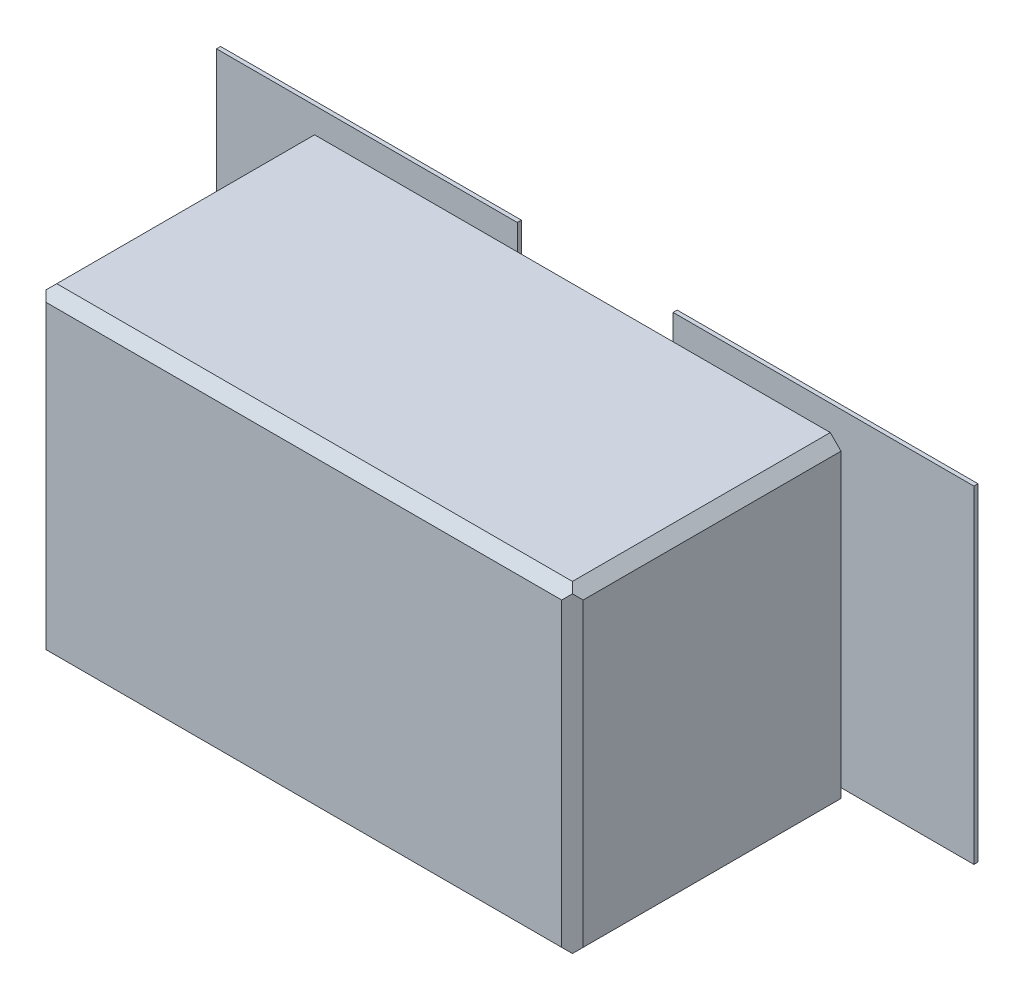
ISO-10303-21;
HEADER;
FILE_DESCRIPTION(('STEP AP214'),'2;1');
FILE_NAME('part.step','',(''),(''),'','','');
FILE_SCHEMA(('AUTOMOTIVE_DESIGN { 1 0 10303 214 1 1 1 1 }'));
ENDSEC;
DATA;
#1=APPLICATION_CONTEXT('core data for automotive mechanical design processes');
#2=APPLICATION_PROTOCOL_DEFINITION('international standard','automotive_design',2000,#1);
#3=PRODUCT_CONTEXT('',#1,'mechanical');
#4=PRODUCT('Part','Part','',(#3));
#5=PRODUCT_RELATED_PRODUCT_CATEGORY('part','',(#4));
#6=PRODUCT_DEFINITION_FORMATION('','',#4);
#7=PRODUCT_DEFINITION_CONTEXT('part definition',#1,'design');
#8=PRODUCT_DEFINITION('design','',#6,#7);
#9=PRODUCT_DEFINITION_SHAPE('','',#8);
#10=(LENGTH_UNIT() NAMED_UNIT(*) SI_UNIT(.MILLI.,.METRE.));
#11=(NAMED_UNIT(*) PLANE_ANGLE_UNIT() SI_UNIT($,.RADIAN.));
#12=(NAMED_UNIT(*) SI_UNIT($,.STERADIAN.) SOLID_ANGLE_UNIT());
#13=UNCERTAINTY_MEASURE_WITH_UNIT(LENGTH_MEASURE(1.E-05),#10,'distance_accuracy_value','');
#14=(GEOMETRIC_REPRESENTATION_CONTEXT(3) GLOBAL_UNCERTAINTY_ASSIGNED_CONTEXT((#13)) GLOBAL_UNIT_ASSIGNED_CONTEXT((#10,
#11,#12)) REPRESENTATION_CONTEXT('',''));
#15=CARTESIAN_POINT('',(0.,0.,0.));
#16=DIRECTION('',(0.,0.,1.));
#17=DIRECTION('',(1.,0.,0.));
#18=AXIS2_PLACEMENT_3D('',#15,#16,#17);
#19=CARTESIAN_POINT('',(-0.49,0.,0.6162));
#20=DIRECTION('',(-0.707106781186548,0.,0.707106781186548));
#21=DIRECTION('',(0.,1.,0.));
#22=AXIS2_PLACEMENT_3D('',#19,#20,#21);
#23=PLANE('',#22);
#24=DIRECTION('',(0.,-1.,0.));
#25=VECTOR('',#24,1.);
#26=CARTESIAN_POINT('',(-0.5,0.28,0.6062));
#27=LINE('',#26,#25);
#28=CARTESIAN_POINT('',(-0.5,0.28,0.6062));
#29=VERTEX_POINT('',#28);
#30=CARTESIAN_POINT('',(-0.5,-0.28,0.6062));
#31=VERTEX_POINT('',#30);
#32=EDGE_CURVE('P0_E323',#29,#31,#27,.T.);
#33=ORIENTED_EDGE('',*,*,#32,.T.);
#34=DIRECTION('',(-0.577350269189626,0.577350269189626,-0.577350269189626));
#35=VECTOR('',#34,1.);
#36=CARTESIAN_POINT('',(-0.49,-0.29,0.6162));
#37=LINE('',#36,#35);
#38=CARTESIAN_POINT('',(-0.49,-0.29,0.6162));
#39=VERTEX_POINT('',#38);
#40=EDGE_CURVE('P0_E324',#39,#31,#37,.T.);
#41=ORIENTED_EDGE('',*,*,#40,.F.);
#42=DIRECTION('',(-0.577350269189626,-0.577350269189626,-0.577350269189626));
#43=VECTOR('',#42,1.);
#44=CARTESIAN_POINT('',(-0.48,-0.28,0.6262));
#45=LINE('',#44,#43);
#46=CARTESIAN_POINT('',(-0.48,-0.28,0.6262));
#47=VERTEX_POINT('',#46);
#48=EDGE_CURVE('P0_E11',#47,#39,#45,.T.);
#49=ORIENTED_EDGE('',*,*,#48,.F.);
#50=DIRECTION('',(0.,-1.,0.));
#51=VECTOR('',#50,1.);
#52=CARTESIAN_POINT('',(-0.48,0.28,0.6262));
#53=LINE('',#52,#51);
#54=CARTESIAN_POINT('',(-0.48,0.28,0.6262));
#55=VERTEX_POINT('',#54);
#56=EDGE_CURVE('P0_E312',#55,#47,#53,.T.);
#57=ORIENTED_EDGE('',*,*,#56,.F.);
#58=DIRECTION('',(0.577350269189626,-0.577350269189626,0.577350269189626));
#59=VECTOR('',#58,1.);
#60=CARTESIAN_POINT('',(-0.49,0.29,0.6162));
#61=LINE('',#60,#59);
#62=CARTESIAN_POINT('',(-0.49,0.29,0.6162));
#63=VERTEX_POINT('',#62);
#64=EDGE_CURVE('P0_E313',#63,#55,#61,.T.);
#65=ORIENTED_EDGE('',*,*,#64,.F.);
#66=DIRECTION('',(0.577350269189626,0.577350269189626,0.577350269189626));
#67=VECTOR('',#66,1.);
#68=CARTESIAN_POINT('',(-0.5,0.28,0.6062));
#69=LINE('',#68,#67);
#70=EDGE_CURVE('P0_E354',#29,#63,#69,.T.);
#71=ORIENTED_EDGE('',*,*,#70,.F.);
#72=EDGE_LOOP('',(#33,#41,#49,#57,#65,#71));
#73=FACE_BOUND('',#72,.T.);
#74=ADVANCED_FACE('P0_F17',(#73),#23,.T.);
#75=CARTESIAN_POINT('',(0.,-0.29,0.6162));
#76=DIRECTION('',(0.,-0.707106781186548,0.707106781186548));
#77=DIRECTION('',(-1.,0.,0.));
#78=AXIS2_PLACEMENT_3D('',#75,#76,#77);
#79=PLANE('',#78);
#80=DIRECTION('',(1.,0.,0.));
#81=VECTOR('',#80,1.);
#82=CARTESIAN_POINT('',(-0.48,-0.3,0.6062));
#83=LINE('',#82,#81);
#84=CARTESIAN_POINT('',(-0.48,-0.3,0.6062));
#85=VERTEX_POINT('',#84);
#86=CARTESIAN_POINT('',(0.48,-0.3,0.6062));
#87=VERTEX_POINT('',#86);
#88=EDGE_CURVE('P0_E252',#85,#87,#83,.T.);
#89=ORIENTED_EDGE('',*,*,#88,.T.);
#90=DIRECTION('',(-0.577350269189626,-0.577350269189626,-0.577350269189626));
#91=VECTOR('',#90,1.);
#92=CARTESIAN_POINT('',(0.49,-0.29,0.6162));
#93=LINE('',#92,#91);
#94=CARTESIAN_POINT('',(0.49,-0.29,0.6162));
#95=VERTEX_POINT('',#94);
#96=EDGE_CURVE('P0_E519',#95,#87,#93,.T.);
#97=ORIENTED_EDGE('',*,*,#96,.F.);
#98=DIRECTION('',(0.577350269189626,-0.577350269189626,-0.577350269189626));
#99=VECTOR('',#98,1.);
#100=CARTESIAN_POINT('',(0.48,-0.28,0.6262));
#101=LINE('',#100,#99);
#102=CARTESIAN_POINT('',(0.48,-0.28,0.6262));
#103=VERTEX_POINT('',#102);
#104=EDGE_CURVE('P0_E28',#103,#95,#101,.T.);
#105=ORIENTED_EDGE('',*,*,#104,.F.);
#106=DIRECTION('',(1.,0.,0.));
#107=VECTOR('',#106,1.);
#108=CARTESIAN_POINT('',(-0.48,-0.28,0.6262));
#109=LINE('',#108,#107);
#110=EDGE_CURVE('P0_E294',#47,#103,#109,.T.);
#111=ORIENTED_EDGE('',*,*,#110,.F.);
#112=ORIENTED_EDGE('',*,*,#48,.T.);
#113=DIRECTION('',(-0.577350269189626,0.577350269189626,0.577350269189626));
#114=VECTOR('',#113,1.);
#115=CARTESIAN_POINT('',(-0.48,-0.3,0.6062));
#116=LINE('',#115,#114);
#117=EDGE_CURVE('P0_E251',#85,#39,#116,.T.);
#118=ORIENTED_EDGE('',*,*,#117,.F.);
#119=EDGE_LOOP('',(#89,#97,#105,#111,#112,#118));
#120=FACE_BOUND('',#119,.T.);
#121=ADVANCED_FACE('P0_F435',(#120),#79,.T.);
#122=CARTESIAN_POINT('',(0.49,0.,0.6162));
#123=DIRECTION('',(0.707106781186548,0.,0.707106781186548));
#124=DIRECTION('',(0.,-1.,0.));
#125=AXIS2_PLACEMENT_3D('',#122,#123,#124);
#126=PLANE('',#125);
#127=DIRECTION('',(0.,1.,0.));
#128=VECTOR('',#127,1.);
#129=CARTESIAN_POINT('',(0.5,-0.28,0.6062));
#130=LINE('',#129,#128);
#131=CARTESIAN_POINT('',(0.5,-0.28,0.6062));
#132=VERTEX_POINT('',#131);
#133=CARTESIAN_POINT('',(0.5,0.28,0.6062));
#134=VERTEX_POINT('',#133);
#135=EDGE_CURVE('P0_E317',#132,#134,#130,.T.);
#136=ORIENTED_EDGE('',*,*,#135,.T.);
#137=DIRECTION('',(0.577350269189626,-0.577350269189626,-0.577350269189626));
#138=VECTOR('',#137,1.);
#139=CARTESIAN_POINT('',(0.49,0.29,0.6162));
#140=LINE('',#139,#138);
#141=CARTESIAN_POINT('',(0.49,0.29,0.6162));
#142=VERTEX_POINT('',#141);
#143=EDGE_CURVE('P0_E303',#142,#134,#140,.T.);
#144=ORIENTED_EDGE('',*,*,#143,.F.);
#145=DIRECTION('',(0.577350269189626,0.577350269189626,-0.577350269189626));
#146=VECTOR('',#145,1.);
#147=CARTESIAN_POINT('',(0.48,0.28,0.6262));
#148=LINE('',#147,#146);
#149=CARTESIAN_POINT('',(0.48,0.28,0.6262));
#150=VERTEX_POINT('',#149);
#151=EDGE_CURVE('P0_E262',#150,#142,#148,.T.);
#152=ORIENTED_EDGE('',*,*,#151,.F.);
#153=DIRECTION('',(0.,1.,0.));
#154=VECTOR('',#153,1.);
#155=CARTESIAN_POINT('',(0.48,-0.28,0.6262));
#156=LINE('',#155,#154);
#157=EDGE_CURVE('P0_E308',#103,#150,#156,.T.);
#158=ORIENTED_EDGE('',*,*,#157,.F.);
#159=ORIENTED_EDGE('',*,*,#104,.T.);
#160=DIRECTION('',(-0.577350269189626,-0.577350269189626,0.577350269189626));
#161=VECTOR('',#160,1.);
#162=CARTESIAN_POINT('',(0.5,-0.28,0.6062));
#163=LINE('',#162,#161);
#164=EDGE_CURVE('P0_E232',#132,#95,#163,.T.);
#165=ORIENTED_EDGE('',*,*,#164,.F.);
#166=EDGE_LOOP('',(#136,#144,#152,#158,#159,#165));
#167=FACE_BOUND('',#166,.T.);
#168=ADVANCED_FACE('P0_F441',(#167),#126,.T.);
#169=CARTESIAN_POINT('',(0.,0.,0.6262));
#170=DIRECTION('',(0.,0.,1.));
#171=DIRECTION('',(1.,0.,0.));
#172=AXIS2_PLACEMENT_3D('',#169,#170,#171);
#173=PLANE('',#172);
#174=ORIENTED_EDGE('',*,*,#157,.T.);
#175=DIRECTION('',(-1.,0.,0.));
#176=VECTOR('',#175,1.);
#177=CARTESIAN_POINT('',(0.48,0.28,0.6262));
#178=LINE('',#177,#176);
#179=EDGE_CURVE('P0_E258',#150,#55,#178,.T.);
#180=ORIENTED_EDGE('',*,*,#179,.T.);
#181=ORIENTED_EDGE('',*,*,#56,.T.);
#182=ORIENTED_EDGE('',*,*,#110,.T.);
#183=EDGE_LOOP('',(#174,#180,#181,#182));
#184=FACE_BOUND('',#183,.T.);
#185=ADVANCED_FACE('P0_F470',(#184),#173,.T.);
#186=CARTESIAN_POINT('',(0.,0.29,0.6162));
#187=DIRECTION('',(0.,0.707106781186548,0.707106781186548));
#188=DIRECTION('',(1.,0.,0.));
#189=AXIS2_PLACEMENT_3D('',#186,#187,#188);
#190=PLANE('',#189);
#191=ORIENTED_EDGE('',*,*,#179,.F.);
#192=ORIENTED_EDGE('',*,*,#151,.T.);
#193=DIRECTION('',(0.577350269189626,-0.577350269189626,0.577350269189626));
#194=VECTOR('',#193,1.);
#195=CARTESIAN_POINT('',(0.48,0.3,0.6062));
#196=LINE('',#195,#194);
#197=CARTESIAN_POINT('',(0.48,0.3,0.6062));
#198=VERTEX_POINT('',#197);
#199=EDGE_CURVE('P0_E267',#198,#142,#196,.T.);
#200=ORIENTED_EDGE('',*,*,#199,.F.);
#201=DIRECTION('',(-1.,0.,0.));
#202=VECTOR('',#201,1.);
#203=CARTESIAN_POINT('',(0.48,0.3,0.6062));
#204=LINE('',#203,#202);
#205=CARTESIAN_POINT('',(-0.48,0.3,0.6062));
#206=VERTEX_POINT('',#205);
#207=EDGE_CURVE('P0_E263',#198,#206,#204,.T.);
#208=ORIENTED_EDGE('',*,*,#207,.T.);
#209=DIRECTION('',(-0.577350269189626,-0.577350269189626,0.577350269189626));
#210=VECTOR('',#209,1.);
#211=CARTESIAN_POINT('',(-0.48,0.3,0.6062));
#212=LINE('',#211,#210);
#213=EDGE_CURVE('P0_E349',#206,#63,#212,.T.);
#214=ORIENTED_EDGE('',*,*,#213,.T.);
#215=ORIENTED_EDGE('',*,*,#64,.T.);
#216=EDGE_LOOP('',(#191,#192,#200,#208,#214,#215));
#217=FACE_BOUND('',#216,.T.);
#218=ADVANCED_FACE('P0_F551',(#217),#190,.T.);
#219=CARTESIAN_POINT('',(0.5,0.3,0.0762));
#220=DIRECTION('',(0.,1.,0.));
#221=DIRECTION('',(1.,0.,0.));
#222=AXIS2_PLACEMENT_3D('',#219,#220,#221);
#223=PLANE('',#222);
#224=DIRECTION('',(0.,0.,-1.));
#225=VECTOR('',#224,1.);
#226=CARTESIAN_POINT('',(0.48,0.3,0.6062));
#227=LINE('',#226,#225);
#228=CARTESIAN_POINT('',(0.48,0.3,0.1262));
#229=VERTEX_POINT('',#228);
#230=EDGE_CURVE('P0_E264',#198,#229,#227,.T.);
#231=ORIENTED_EDGE('',*,*,#230,.T.);
#232=DIRECTION('',(-1.,0.,0.));
#233=VECTOR('',#232,1.);
#234=CARTESIAN_POINT('',(0.48,0.3,0.1262));
#235=LINE('',#234,#233);
#236=CARTESIAN_POINT('',(-0.48,0.3,0.1262));
#237=VERTEX_POINT('',#236);
#238=EDGE_CURVE('P0_E290',#229,#237,#235,.T.);
#239=ORIENTED_EDGE('',*,*,#238,.T.);
#240=DIRECTION('',(0.,0.,-1.));
#241=VECTOR('',#240,1.);
#242=CARTESIAN_POINT('',(-0.48,0.3,0.6062));
#243=LINE('',#242,#241);
#244=EDGE_CURVE('P0_E353',#206,#237,#243,.T.);
#245=ORIENTED_EDGE('',*,*,#244,.F.);
#246=ORIENTED_EDGE('',*,*,#207,.F.);
#247=EDGE_LOOP('',(#231,#239,#245,#246));
#248=FACE_BOUND('',#247,.T.);
#249=ADVANCED_FACE('P0_F406',(#248),#223,.T.);
#250=CARTESIAN_POINT('',(-0.49,0.29,0.3762));
#251=DIRECTION('',(-0.707106781186548,0.707106781186548,0.));
#252=DIRECTION('',(0.,0.,1.));
#253=AXIS2_PLACEMENT_3D('',#250,#251,#252);
#254=PLANE('',#253);
#255=DIRECTION('',(0.707106781186548,0.707106781186548,0.));
#256=VECTOR('',#255,1.);
#257=CARTESIAN_POINT('',(-0.5,0.28,0.1262));
#258=LINE('',#257,#256);
#259=CARTESIAN_POINT('',(-0.5,0.28,0.1262));
#260=VERTEX_POINT('',#259);
#261=EDGE_CURVE('P0_E345',#260,#237,#258,.T.);
#262=ORIENTED_EDGE('',*,*,#261,.F.);
#263=DIRECTION('',(0.,0.,-1.));
#264=VECTOR('',#263,1.);
#265=CARTESIAN_POINT('',(-0.5,0.28,0.6062));
#266=LINE('',#265,#264);
#267=EDGE_CURVE('P0_E341',#29,#260,#266,.T.);
#268=ORIENTED_EDGE('',*,*,#267,.F.);
#269=ORIENTED_EDGE('',*,*,#70,.T.);
#270=ORIENTED_EDGE('',*,*,#213,.F.);
#271=ORIENTED_EDGE('',*,*,#244,.T.);
#272=EDGE_LOOP('',(#262,#268,#269,#270,#271));
#273=FACE_BOUND('',#272,.T.);
#274=ADVANCED_FACE('P0_F398',(#273),#254,.T.);
#275=CARTESIAN_POINT('',(-0.5,0.3,0.0762));
#276=DIRECTION('',(-1.,0.,0.));
#277=DIRECTION('',(0.,0.,1.));
#278=AXIS2_PLACEMENT_3D('',#275,#276,#277);
#279=PLANE('',#278);
#280=DIRECTION('',(0.,0.,-1.));
#281=VECTOR('',#280,1.);
#282=CARTESIAN_POINT('',(-0.5,-0.28,0.6062));
#283=LINE('',#282,#281);
#284=CARTESIAN_POINT('',(-0.5,-0.28,0.1262));
#285=VERTEX_POINT('',#284);
#286=EDGE_CURVE('P0_E320',#31,#285,#283,.T.);
#287=ORIENTED_EDGE('',*,*,#286,.F.);
#288=ORIENTED_EDGE('',*,*,#32,.F.);
#289=ORIENTED_EDGE('',*,*,#267,.T.);
#290=DIRECTION('',(0.,-1.,0.));
#291=VECTOR('',#290,1.);
#292=CARTESIAN_POINT('',(-0.5,0.28,0.1262));
#293=LINE('',#292,#291);
#294=EDGE_CURVE('P0_E243',#260,#285,#293,.T.);
#295=ORIENTED_EDGE('',*,*,#294,.T.);
#296=EDGE_LOOP('',(#287,#288,#289,#295));
#297=FACE_BOUND('',#296,.T.);
#298=ADVANCED_FACE('P0_F473',(#297),#279,.T.);
#299=CARTESIAN_POINT('',(-0.49,-0.29,0.3762));
#300=DIRECTION('',(-0.707106781186548,-0.707106781186548,0.));
#301=DIRECTION('',(-0.707106781186548,0.707106781186548,0.));
#302=AXIS2_PLACEMENT_3D('',#299,#300,#301);
#303=PLANE('',#302);
#304=DIRECTION('',(-0.707106781186548,0.707106781186548,0.));
#305=VECTOR('',#304,1.);
#306=CARTESIAN_POINT('',(-0.48,-0.3,0.1262));
#307=LINE('',#306,#305);
#308=CARTESIAN_POINT('',(-0.48,-0.3,0.1262));
#309=VERTEX_POINT('',#308);
#310=EDGE_CURVE('P0_E239',#309,#285,#307,.T.);
#311=ORIENTED_EDGE('',*,*,#310,.F.);
#312=DIRECTION('',(0.,0.,-1.));
#313=VECTOR('',#312,1.);
#314=CARTESIAN_POINT('',(-0.48,-0.3,0.6062));
#315=LINE('',#314,#313);
#316=EDGE_CURVE('P0_E166',#85,#309,#315,.T.);
#317=ORIENTED_EDGE('',*,*,#316,.F.);
#318=ORIENTED_EDGE('',*,*,#117,.T.);
#319=ORIENTED_EDGE('',*,*,#40,.T.);
#320=ORIENTED_EDGE('',*,*,#286,.T.);
#321=EDGE_LOOP('',(#311,#317,#318,#319,#320));
#322=FACE_BOUND('',#321,.T.);
#323=ADVANCED_FACE('P0_F430',(#322),#303,.T.);
#324=CARTESIAN_POINT('',(-0.5,-0.3,0.0762));
#325=DIRECTION('',(0.,-1.,0.));
#326=DIRECTION('',(0.,0.,-1.));
#327=AXIS2_PLACEMENT_3D('',#324,#325,#326);
#328=PLANE('',#327);
#329=DIRECTION('',(0.,0.,-1.));
#330=VECTOR('',#329,1.);
#331=CARTESIAN_POINT('',(0.48,-0.3,0.6062));
#332=LINE('',#331,#330);
#333=CARTESIAN_POINT('',(0.48,-0.3,0.1262));
#334=VERTEX_POINT('',#333);
#335=EDGE_CURVE('P0_E155',#87,#334,#332,.T.);
#336=ORIENTED_EDGE('',*,*,#335,.F.);
#337=ORIENTED_EDGE('',*,*,#88,.F.);
#338=ORIENTED_EDGE('',*,*,#316,.T.);
#339=DIRECTION('',(1.,0.,0.));
#340=VECTOR('',#339,1.);
#341=CARTESIAN_POINT('',(-0.48,-0.3,0.1262));
#342=LINE('',#341,#340);
#343=EDGE_CURVE('P0_E244',#309,#334,#342,.T.);
#344=ORIENTED_EDGE('',*,*,#343,.T.);
#345=EDGE_LOOP('',(#336,#337,#338,#344));
#346=FACE_BOUND('',#345,.T.);
#347=ADVANCED_FACE('P0_F421',(#346),#328,.T.);
#348=CARTESIAN_POINT('',(0.49,-0.29,0.3762));
#349=DIRECTION('',(0.707106781186548,-0.707106781186548,0.));
#350=DIRECTION('',(0.,0.,-1.));
#351=AXIS2_PLACEMENT_3D('',#348,#349,#350);
#352=PLANE('',#351);
#353=DIRECTION('',(-0.707106781186548,-0.707106781186548,0.));
#354=VECTOR('',#353,1.);
#355=CARTESIAN_POINT('',(0.5,-0.28,0.1262));
#356=LINE('',#355,#354);
#357=CARTESIAN_POINT('',(0.5,-0.28,0.1262));
#358=VERTEX_POINT('',#357);
#359=EDGE_CURVE('P0_E237',#358,#334,#356,.T.);
#360=ORIENTED_EDGE('',*,*,#359,.F.);
#361=DIRECTION('',(0.,0.,-1.));
#362=VECTOR('',#361,1.);
#363=CARTESIAN_POINT('',(0.5,-0.28,0.6062));
#364=LINE('',#363,#362);
#365=EDGE_CURVE('P0_E314',#132,#358,#364,.T.);
#366=ORIENTED_EDGE('',*,*,#365,.F.);
#367=ORIENTED_EDGE('',*,*,#164,.T.);
#368=ORIENTED_EDGE('',*,*,#96,.T.);
#369=ORIENTED_EDGE('',*,*,#335,.T.);
#370=EDGE_LOOP('',(#360,#366,#367,#368,#369));
#371=FACE_BOUND('',#370,.T.);
#372=ADVANCED_FACE('P0_F419',(#371),#352,.T.);
#373=CARTESIAN_POINT('',(0.5,-0.3,0.0762));
#374=DIRECTION('',(1.,0.,0.));
#375=DIRECTION('',(0.,1.,0.));
#376=AXIS2_PLACEMENT_3D('',#373,#374,#375);
#377=PLANE('',#376);
#378=DIRECTION('',(0.,0.,-1.));
#379=VECTOR('',#378,1.);
#380=CARTESIAN_POINT('',(0.5,0.28,0.6062));
#381=LINE('',#380,#379);
#382=CARTESIAN_POINT('',(0.5,0.28,0.1262));
#383=VERTEX_POINT('',#382);
#384=EDGE_CURVE('P0_E327',#134,#383,#381,.T.);
#385=ORIENTED_EDGE('',*,*,#384,.F.);
#386=ORIENTED_EDGE('',*,*,#135,.F.);
#387=ORIENTED_EDGE('',*,*,#365,.T.);
#388=DIRECTION('',(0.,1.,0.));
#389=VECTOR('',#388,1.);
#390=CARTESIAN_POINT('',(0.5,-0.28,0.1262));
#391=LINE('',#390,#389);
#392=EDGE_CURVE('P0_E234',#358,#383,#391,.T.);
#393=ORIENTED_EDGE('',*,*,#392,.T.);
#394=EDGE_LOOP('',(#385,#386,#387,#393));
#395=FACE_BOUND('',#394,.T.);
#396=ADVANCED_FACE('P0_F415',(#395),#377,.T.);
#397=CARTESIAN_POINT('',(0.49,0.29,0.3762));
#398=DIRECTION('',(0.707106781186548,0.707106781186548,0.));
#399=DIRECTION('',(0.,0.,-1.));
#400=AXIS2_PLACEMENT_3D('',#397,#398,#399);
#401=PLANE('',#400);
#402=DIRECTION('',(0.707106781186498,-0.707106781186598,0.));
#403=VECTOR('',#402,1.);
#404=CARTESIAN_POINT('',(0.48,0.3,0.1262));
#405=LINE('',#404,#403);
#406=EDGE_CURVE('P0_E217',#229,#383,#405,.T.);
#407=ORIENTED_EDGE('',*,*,#406,.F.);
#408=ORIENTED_EDGE('',*,*,#230,.F.);
#409=ORIENTED_EDGE('',*,*,#199,.T.);
#410=ORIENTED_EDGE('',*,*,#143,.T.);
#411=ORIENTED_EDGE('',*,*,#384,.T.);
#412=EDGE_LOOP('',(#407,#408,#409,#410,#411));
#413=FACE_BOUND('',#412,.T.);
#414=ADVANCED_FACE('P0_F410',(#413),#401,.T.);
#415=CARTESIAN_POINT('',(-0.4659973957868,-0.25,0.1262));
#416=DIRECTION('',(-1.,0.,0.));
#417=DIRECTION('',(0.,0.,1.));
#418=AXIS2_PLACEMENT_3D('',#415,#416,#417);
#419=PLANE('',#418);
#420=DIRECTION('',(0.,1.,0.));
#421=VECTOR('',#420,1.);
#422=CARTESIAN_POINT('',(-0.4659973957868,-0.25,0.1262));
#423=LINE('',#422,#421);
#424=CARTESIAN_POINT('',(-0.4659973957868,-0.25,0.1262));
#425=VERTEX_POINT('',#424);
#426=CARTESIAN_POINT('',(-0.4659973957868,0.2,0.1262));
#427=VERTEX_POINT('',#426);
#428=EDGE_CURVE('P0_E366',#425,#427,#423,.T.);
#429=ORIENTED_EDGE('',*,*,#428,.T.);
#430=DIRECTION('',(0.,0.,-1.));
#431=VECTOR('',#430,1.);
#432=CARTESIAN_POINT('',(-0.4659973957868,0.2,0.1262));
#433=LINE('',#432,#431);
#434=CARTESIAN_POINT('',(-0.4659973957868,0.2,0.0862));
#435=VERTEX_POINT('',#434);
#436=EDGE_CURVE('P0_E268',#427,#435,#433,.T.);
#437=ORIENTED_EDGE('',*,*,#436,.T.);
#438=DIRECTION('',(0.,1.,0.));
#439=VECTOR('',#438,1.);
#440=CARTESIAN_POINT('',(-0.4659973957868,-0.25,0.0862));
#441=LINE('',#440,#439);
#442=CARTESIAN_POINT('',(-0.4659973957868,-0.25,0.0862));
#443=VERTEX_POINT('',#442);
#444=EDGE_CURVE('P0_E205',#443,#435,#441,.T.);
#445=ORIENTED_EDGE('',*,*,#444,.F.);
#446=DIRECTION('',(0.,0.,-1.));
#447=VECTOR('',#446,1.);
#448=CARTESIAN_POINT('',(-0.4659973957868,-0.25,0.1262));
#449=LINE('',#448,#447);
#450=EDGE_CURVE('P0_E221',#425,#443,#449,.T.);
#451=ORIENTED_EDGE('',*,*,#450,.F.);
#452=EDGE_LOOP('',(#429,#437,#445,#451));
#453=FACE_BOUND('',#452,.T.);
#454=ADVANCED_FACE('P0_F455',(#453),#419,.T.);
#455=CARTESIAN_POINT('',(-0.4659973957868,0.25,0.1262));
#456=DIRECTION('',(0.,0.,-1.));
#457=DIRECTION('',(-1.,0.,0.));
#458=AXIS2_PLACEMENT_3D('',#455,#456,#457);
#459=CYLINDRICAL_SURFACE('',#458,0.05);
#460=CARTESIAN_POINT('',(-0.4659973957868,0.25,0.1262));
#461=DIRECTION('',(0.,0.,-1.));
#462=DIRECTION('',(1.,0.,0.));
#463=AXIS2_PLACEMENT_3D('',#460,#461,#462);
#464=CIRCLE('',#463,0.05);
#465=CARTESIAN_POINT('',(-0.4159973957868,0.25,0.1262));
#466=VERTEX_POINT('',#465);
#467=EDGE_CURVE('P0_E257',#466,#427,#464,.T.);
#468=ORIENTED_EDGE('',*,*,#467,.F.);
#469=DIRECTION('',(0.,0.,-1.));
#470=VECTOR('',#469,1.);
#471=CARTESIAN_POINT('',(-0.4159973957868,0.25,0.1262));
#472=LINE('',#471,#470);
#473=CARTESIAN_POINT('',(-0.4159973957868,0.25,0.0862));
#474=VERTEX_POINT('',#473);
#475=EDGE_CURVE('P0_E332',#466,#474,#472,.T.);
#476=ORIENTED_EDGE('',*,*,#475,.T.);
#477=CARTESIAN_POINT('',(-0.4659973957868,0.25,0.0862));
#478=DIRECTION('',(0.,0.,1.));
#479=DIRECTION('',(0.,-1.,0.));
#480=AXIS2_PLACEMENT_3D('',#477,#478,#479);
#481=CIRCLE('',#480,0.05);
#482=EDGE_CURVE('P0_E248',#435,#474,#481,.T.);
#483=ORIENTED_EDGE('',*,*,#482,.F.);
#484=ORIENTED_EDGE('',*,*,#436,.F.);
#485=EDGE_LOOP('',(#468,#476,#483,#484));
#486=FACE_BOUND('',#485,.T.);
#487=ADVANCED_FACE('P0_F451',(#486),#459,.F.);
#488=CARTESIAN_POINT('',(-0.4159973957868,0.25,0.1262));
#489=DIRECTION('',(0.,1.,0.));
#490=DIRECTION('',(1.,0.,0.));
#491=AXIS2_PLACEMENT_3D('',#488,#489,#490);
#492=PLANE('',#491);
#493=DIRECTION('',(1.,0.,0.));
#494=VECTOR('',#493,1.);
#495=CARTESIAN_POINT('',(-0.4159973957868,0.25,0.1262));
#496=LINE('',#495,#494);
#497=CARTESIAN_POINT('',(-0.2159973957868,0.25,0.1262));
#498=VERTEX_POINT('',#497);
#499=EDGE_CURVE('P0_E253',#466,#498,#496,.T.);
#500=ORIENTED_EDGE('',*,*,#499,.T.);
#501=DIRECTION('',(0.,0.,-1.));
#502=VECTOR('',#501,1.);
#503=CARTESIAN_POINT('',(-0.2159973957868,0.25,0.1262));
#504=LINE('',#503,#502);
#505=CARTESIAN_POINT('',(-0.2159973957868,0.25,0.0862));
#506=VERTEX_POINT('',#505);
#507=EDGE_CURVE('P0_E247',#498,#506,#504,.T.);
#508=ORIENTED_EDGE('',*,*,#507,.T.);
#509=DIRECTION('',(1.,0.,0.));
#510=VECTOR('',#509,1.);
#511=CARTESIAN_POINT('',(-0.4159973957868,0.25,0.0862));
#512=LINE('',#511,#510);
#513=EDGE_CURVE('P0_E202',#474,#506,#512,.T.);
#514=ORIENTED_EDGE('',*,*,#513,.F.);
#515=ORIENTED_EDGE('',*,*,#475,.F.);
#516=EDGE_LOOP('',(#500,#508,#514,#515));
#517=FACE_BOUND('',#516,.T.);
#518=ADVANCED_FACE('P0_F448',(#517),#492,.T.);
#519=CARTESIAN_POINT('',(-0.2159973957868,0.25,0.1262));
#520=DIRECTION('',(1.,0.,0.));
#521=DIRECTION('',(0.,1.,0.));
#522=AXIS2_PLACEMENT_3D('',#519,#520,#521);
#523=PLANE('',#522);
#524=DIRECTION('',(0.,-1.,0.));
#525=VECTOR('',#524,1.);
#526=CARTESIAN_POINT('',(-0.2159973957868,0.25,0.1262));
#527=LINE('',#526,#525);
#528=CARTESIAN_POINT('',(-0.2159973957868,-0.25,0.1262));
#529=VERTEX_POINT('',#528);
#530=EDGE_CURVE('P0_E212',#498,#529,#527,.T.);
#531=ORIENTED_EDGE('',*,*,#530,.T.);
#532=DIRECTION('',(0.,0.,-1.));
#533=VECTOR('',#532,1.);
#534=CARTESIAN_POINT('',(-0.2159973957868,-0.25,0.1262));
#535=LINE('',#534,#533);
#536=CARTESIAN_POINT('',(-0.2159973957868,-0.25,0.0862));
#537=VERTEX_POINT('',#536);
#538=EDGE_CURVE('P0_E209',#529,#537,#535,.T.);
#539=ORIENTED_EDGE('',*,*,#538,.T.);
#540=DIRECTION('',(0.,-1.,0.));
#541=VECTOR('',#540,1.);
#542=CARTESIAN_POINT('',(-0.2159973957868,0.25,0.0862));
#543=LINE('',#542,#541);
#544=EDGE_CURVE('P0_E193',#506,#537,#543,.T.);
#545=ORIENTED_EDGE('',*,*,#544,.F.);
#546=ORIENTED_EDGE('',*,*,#507,.F.);
#547=EDGE_LOOP('',(#531,#539,#545,#546));
#548=FACE_BOUND('',#547,.T.);
#549=ADVANCED_FACE('P0_F210',(#548),#523,.T.);
#550=CARTESIAN_POINT('',(0.,0.,0.0862));
#551=DIRECTION('',(0.,0.,-1.));
#552=DIRECTION('',(0.,-1.,0.));
#553=AXIS2_PLACEMENT_3D('',#550,#551,#552);
#554=PLANE('',#553);
#555=ORIENTED_EDGE('',*,*,#544,.T.);
#556=DIRECTION('',(-1.,0.,0.));
#557=VECTOR('',#556,1.);
#558=CARTESIAN_POINT('',(-0.2159973957868,-0.25,0.0862));
#559=LINE('',#558,#557);
#560=EDGE_CURVE('P0_E198',#537,#443,#559,.T.);
#561=ORIENTED_EDGE('',*,*,#560,.T.);
#562=ORIENTED_EDGE('',*,*,#444,.T.);
#563=ORIENTED_EDGE('',*,*,#482,.T.);
#564=ORIENTED_EDGE('',*,*,#513,.T.);
#565=EDGE_LOOP('',(#555,#561,#562,#563,#564));
#566=FACE_BOUND('',#565,.T.);
#567=ADVANCED_FACE('P0_F195',(#566),#554,.T.);
#568=CARTESIAN_POINT('',(0.,0.,0.0862));
#569=DIRECTION('',(0.,0.,-1.));
#570=DIRECTION('',(0.,-1.,0.));
#571=AXIS2_PLACEMENT_3D('',#568,#569,#570);
#572=PLANE('',#571);
#573=DIRECTION('',(0.,-1.,0.));
#574=VECTOR('',#573,1.);
#575=CARTESIAN_POINT('',(0.4340026042132,0.25,0.0862));
#576=LINE('',#575,#574);
#577=CARTESIAN_POINT('',(0.4340026042132,0.25,0.0862));
#578=VERTEX_POINT('',#577);
#579=CARTESIAN_POINT('',(0.4340026042132,-0.25,0.0862));
#580=VERTEX_POINT('',#579);
#581=EDGE_CURVE('P0_E273',#578,#580,#576,.T.);
#582=ORIENTED_EDGE('',*,*,#581,.T.);
#583=DIRECTION('',(-1.,0.,0.));
#584=VECTOR('',#583,1.);
#585=CARTESIAN_POINT('',(0.4340026042132,-0.25,0.0862));
#586=LINE('',#585,#584);
#587=CARTESIAN_POINT('',(0.1840026042132,-0.25,0.0862));
#588=VERTEX_POINT('',#587);
#589=EDGE_CURVE('P0_E206',#580,#588,#586,.T.);
#590=ORIENTED_EDGE('',*,*,#589,.T.);
#591=DIRECTION('',(0.,1.,0.));
#592=VECTOR('',#591,1.);
#593=CARTESIAN_POINT('',(0.1840026042132,-0.25,0.0862));
#594=LINE('',#593,#592);
#595=CARTESIAN_POINT('',(0.1840026042132,0.25,0.0862));
#596=VERTEX_POINT('',#595);
#597=EDGE_CURVE('P0_E21',#588,#596,#594,.T.);
#598=ORIENTED_EDGE('',*,*,#597,.T.);
#599=DIRECTION('',(1.,0.,0.));
#600=VECTOR('',#599,1.);
#601=CARTESIAN_POINT('',(0.1840026042132,0.25,0.0862));
#602=LINE('',#601,#600);
#603=EDGE_CURVE('P0_E275',#596,#578,#602,.T.);
#604=ORIENTED_EDGE('',*,*,#603,.T.);
#605=EDGE_LOOP('',(#582,#590,#598,#604));
#606=FACE_BOUND('',#605,.T.);
#607=ADVANCED_FACE('P0_F464',(#606),#572,.T.);
#608=CARTESIAN_POINT('',(0.4340026042132,-0.25,0.1262));
#609=DIRECTION('',(0.,-1.,0.));
#610=DIRECTION('',(0.,0.,-1.));
#611=AXIS2_PLACEMENT_3D('',#608,#609,#610);
#612=PLANE('',#611);
#613=DIRECTION('',(-1.,0.,0.));
#614=VECTOR('',#613,1.);
#615=CARTESIAN_POINT('',(0.4340026042132,-0.25,0.1262));
#616=LINE('',#615,#614);
#617=CARTESIAN_POINT('',(0.4340026042132,-0.25,0.1262));
#618=VERTEX_POINT('',#617);
#619=CARTESIAN_POINT('',(0.1840026042132,-0.25,0.1262));
#620=VERTEX_POINT('',#619);
#621=EDGE_CURVE('P0_E274',#618,#620,#616,.T.);
#622=ORIENTED_EDGE('',*,*,#621,.T.);
#623=DIRECTION('',(0.,0.,-1.));
#624=VECTOR('',#623,1.);
#625=CARTESIAN_POINT('',(0.1840026042132,-0.25,0.1262));
#626=LINE('',#625,#624);
#627=EDGE_CURVE('P0_E287',#620,#588,#626,.T.);
#628=ORIENTED_EDGE('',*,*,#627,.T.);
#629=ORIENTED_EDGE('',*,*,#589,.F.);
#630=DIRECTION('',(0.,0.,-1.));
#631=VECTOR('',#630,1.);
#632=CARTESIAN_POINT('',(0.4340026042132,-0.25,0.1262));
#633=LINE('',#632,#631);
#634=EDGE_CURVE('P0_E269',#618,#580,#633,.T.);
#635=ORIENTED_EDGE('',*,*,#634,.F.);
#636=EDGE_LOOP('',(#622,#628,#629,#635));
#637=FACE_BOUND('',#636,.T.);
#638=ADVANCED_FACE('P0_F446',(#637),#612,.T.);
#639=CARTESIAN_POINT('',(0.1840026042132,-0.25,0.1262));
#640=DIRECTION('',(-1.,0.,0.));
#641=DIRECTION('',(0.,0.,1.));
#642=AXIS2_PLACEMENT_3D('',#639,#640,#641);
#643=PLANE('',#642);
#644=DIRECTION('',(0.,1.,0.));
#645=VECTOR('',#644,1.);
#646=CARTESIAN_POINT('',(0.1840026042132,-0.25,0.1262));
#647=LINE('',#646,#645);
#648=CARTESIAN_POINT('',(0.1840026042132,0.25,0.1262));
#649=VERTEX_POINT('',#648);
#650=EDGE_CURVE('P0_E295',#620,#649,#647,.T.);
#651=ORIENTED_EDGE('',*,*,#650,.T.);
#652=DIRECTION('',(0.,0.,-1.));
#653=VECTOR('',#652,1.);
#654=CARTESIAN_POINT('',(0.1840026042132,0.25,0.1262));
#655=LINE('',#654,#653);
#656=EDGE_CURVE('P0_E279',#649,#596,#655,.T.);
#657=ORIENTED_EDGE('',*,*,#656,.T.);
#658=ORIENTED_EDGE('',*,*,#597,.F.);
#659=ORIENTED_EDGE('',*,*,#627,.F.);
#660=EDGE_LOOP('',(#651,#657,#658,#659));
#661=FACE_BOUND('',#660,.T.);
#662=ADVANCED_FACE('P0_F549',(#661),#643,.T.);
#663=CARTESIAN_POINT('',(0.1840026042132,0.25,0.1262));
#664=DIRECTION('',(0.,1.,0.));
#665=DIRECTION('',(1.,0.,0.));
#666=AXIS2_PLACEMENT_3D('',#663,#664,#665);
#667=PLANE('',#666);
#668=DIRECTION('',(1.,0.,0.));
#669=VECTOR('',#668,1.);
#670=CARTESIAN_POINT('',(0.1840026042132,0.25,0.1262));
#671=LINE('',#670,#669);
#672=CARTESIAN_POINT('',(0.4340026042132,0.25,0.1262));
#673=VERTEX_POINT('',#672);
#674=EDGE_CURVE('P0_E299',#649,#673,#671,.T.);
#675=ORIENTED_EDGE('',*,*,#674,.T.);
#676=DIRECTION('',(0.,0.,-1.));
#677=VECTOR('',#676,1.);
#678=CARTESIAN_POINT('',(0.4340026042132,0.25,0.1262));
#679=LINE('',#678,#677);
#680=EDGE_CURVE('P0_E280',#673,#578,#679,.T.);
#681=ORIENTED_EDGE('',*,*,#680,.T.);
#682=ORIENTED_EDGE('',*,*,#603,.F.);
#683=ORIENTED_EDGE('',*,*,#656,.F.);
#684=EDGE_LOOP('',(#675,#681,#682,#683));
#685=FACE_BOUND('',#684,.T.);
#686=ADVANCED_FACE('P0_F788',(#685),#667,.T.);
#687=CARTESIAN_POINT('',(0.4340026042132,0.25,0.1262));
#688=DIRECTION('',(1.,0.,0.));
#689=DIRECTION('',(0.,1.,0.));
#690=AXIS2_PLACEMENT_3D('',#687,#688,#689);
#691=PLANE('',#690);
#692=DIRECTION('',(0.,-1.,0.));
#693=VECTOR('',#692,1.);
#694=CARTESIAN_POINT('',(0.4340026042132,0.25,0.1262));
#695=LINE('',#694,#693);
#696=EDGE_CURVE('P0_E307',#673,#618,#695,.T.);
#697=ORIENTED_EDGE('',*,*,#696,.T.);
#698=ORIENTED_EDGE('',*,*,#634,.T.);
#699=ORIENTED_EDGE('',*,*,#581,.F.);
#700=ORIENTED_EDGE('',*,*,#680,.F.);
#701=EDGE_LOOP('',(#697,#698,#699,#700));
#702=FACE_BOUND('',#701,.T.);
#703=ADVANCED_FACE('P0_F19',(#702),#691,.T.);
#704=CARTESIAN_POINT('',(0.,0.,0.1262));
#705=DIRECTION('',(0.,0.,1.));
#706=DIRECTION('',(1.,0.,0.));
#707=AXIS2_PLACEMENT_3D('',#704,#705,#706);
#708=PLANE('',#707);
#709=ORIENTED_EDGE('',*,*,#696,.F.);
#710=ORIENTED_EDGE('',*,*,#674,.F.);
#711=ORIENTED_EDGE('',*,*,#650,.F.);
#712=ORIENTED_EDGE('',*,*,#621,.F.);
#713=EDGE_LOOP('',(#709,#710,#711,#712));
#714=FACE_BOUND('',#713,.T.);
#715=ORIENTED_EDGE('',*,*,#530,.F.);
#716=ORIENTED_EDGE('',*,*,#499,.F.);
#717=ORIENTED_EDGE('',*,*,#467,.T.);
#718=ORIENTED_EDGE('',*,*,#428,.F.);
#719=DIRECTION('',(-1.,0.,0.));
#720=VECTOR('',#719,1.);
#721=CARTESIAN_POINT('',(-0.2159973957868,-0.25,0.1262));
#722=LINE('',#721,#720);
#723=EDGE_CURVE('P0_E228',#529,#425,#722,.T.);
#724=ORIENTED_EDGE('',*,*,#723,.F.);
#725=EDGE_LOOP('',(#715,#716,#717,#718,#724));
#726=FACE_BOUND('',#725,.T.);
#727=ORIENTED_EDGE('',*,*,#406,.T.);
#728=ORIENTED_EDGE('',*,*,#392,.F.);
#729=ORIENTED_EDGE('',*,*,#359,.T.);
#730=ORIENTED_EDGE('',*,*,#343,.F.);
#731=ORIENTED_EDGE('',*,*,#310,.T.);
#732=ORIENTED_EDGE('',*,*,#294,.F.);
#733=ORIENTED_EDGE('',*,*,#261,.T.);
#734=ORIENTED_EDGE('',*,*,#238,.F.);
#735=EDGE_LOOP('',(#727,#728,#729,#730,#731,#732,#733,#734));
#736=FACE_BOUND('',#735,.T.);
#737=ADVANCED_FACE('P0_F394',(#714,#726,#736),#708,.F.);
#738=CARTESIAN_POINT('',(-0.2159973957868,-0.25,0.1262));
#739=DIRECTION('',(0.,-1.,0.));
#740=DIRECTION('',(0.,0.,-1.));
#741=AXIS2_PLACEMENT_3D('',#738,#739,#740);
#742=PLANE('',#741);
#743=ORIENTED_EDGE('',*,*,#723,.T.);
#744=ORIENTED_EDGE('',*,*,#450,.T.);
#745=ORIENTED_EDGE('',*,*,#560,.F.);
#746=ORIENTED_EDGE('',*,*,#538,.F.);
#747=EDGE_LOOP('',(#743,#744,#745,#746));
#748=FACE_BOUND('',#747,.T.);
#749=ADVANCED_FACE('P0_F219',(#748),#742,.T.);
#750=CLOSED_SHELL('',(#74,#121,#168,#185,#218,#249,#274,#298,#323,#347,#372,#396,#414,#454,#487,
#518,#549,#567,#607,#638,#662,#686,#703,#737,#749));
#751=MANIFOLD_SOLID_BREP('P0_B1',#750);
#752=CARTESIAN_POINT('',(0.,0.,0.08382));
#753=DIRECTION('',(0.,0.,1.));
#754=DIRECTION('',(1.,0.,0.));
#755=AXIS2_PLACEMENT_3D('',#752,#753,#754);
#756=PLANE('',#755);
#757=DIRECTION('',(1.,0.,0.));
#758=VECTOR('',#757,1.);
#759=CARTESIAN_POINT('',(-0.705,-0.305,0.08382));
#760=LINE('',#759,#758);
#761=CARTESIAN_POINT('',(-0.705,-0.305,0.08382));
#762=VERTEX_POINT('',#761);
#763=CARTESIAN_POINT('',(-0.145,-0.305,0.08382));
#764=VERTEX_POINT('',#763);
#765=EDGE_CURVE('P1_E20',#762,#764,#760,.T.);
#766=ORIENTED_EDGE('',*,*,#765,.T.);
#767=DIRECTION('',(0.,1.,0.));
#768=VECTOR('',#767,1.);
#769=CARTESIAN_POINT('',(-0.145,-0.305,0.08382));
#770=LINE('',#769,#768);
#771=CARTESIAN_POINT('',(-0.145,0.305,0.08382));
#772=VERTEX_POINT('',#771);
#773=EDGE_CURVE('P1_E11',#764,#772,#770,.T.);
#774=ORIENTED_EDGE('',*,*,#773,.T.);
#775=DIRECTION('',(-1.,0.,0.));
#776=VECTOR('',#775,1.);
#777=CARTESIAN_POINT('',(-0.145,0.305,0.08382));
#778=LINE('',#777,#776);
#779=CARTESIAN_POINT('',(-0.705,0.305,0.08382));
#780=VERTEX_POINT('',#779);
#781=EDGE_CURVE('P1_E70',#772,#780,#778,.T.);
#782=ORIENTED_EDGE('',*,*,#781,.T.);
#783=DIRECTION('',(0.,-1.,0.));
#784=VECTOR('',#783,1.);
#785=CARTESIAN_POINT('',(-0.705,0.305,0.08382));
#786=LINE('',#785,#784);
#787=EDGE_CURVE('P1_E65',#780,#762,#786,.T.);
#788=ORIENTED_EDGE('',*,*,#787,.T.);
#789=EDGE_LOOP('',(#766,#774,#782,#788));
#790=FACE_BOUND('',#789,.T.);
#791=ADVANCED_FACE('P1_F17',(#790),#756,.T.);
#792=CARTESIAN_POINT('',(-0.145,-0.305,0.0762));
#793=DIRECTION('',(1.,0.,0.));
#794=DIRECTION('',(0.,1.,0.));
#795=AXIS2_PLACEMENT_3D('',#792,#793,#794);
#796=PLANE('',#795);
#797=DIRECTION('',(0.,1.,0.));
#798=VECTOR('',#797,1.);
#799=CARTESIAN_POINT('',(-0.145,-0.305,0.0762));
#800=LINE('',#799,#798);
#801=CARTESIAN_POINT('',(-0.145,-0.305,0.0762));
#802=VERTEX_POINT('',#801);
#803=CARTESIAN_POINT('',(-0.145,0.305,0.0762));
#804=VERTEX_POINT('',#803);
#805=EDGE_CURVE('P1_E94',#802,#804,#800,.T.);
#806=ORIENTED_EDGE('',*,*,#805,.T.);
#807=DIRECTION('',(0.,0.,1.));
#808=VECTOR('',#807,1.);
#809=CARTESIAN_POINT('',(-0.145,0.305,0.0762));
#810=LINE('',#809,#808);
#811=EDGE_CURVE('P1_E27',#804,#772,#810,.T.);
#812=ORIENTED_EDGE('',*,*,#811,.T.);
#813=ORIENTED_EDGE('',*,*,#773,.F.);
#814=DIRECTION('',(0.,0.,1.));
#815=VECTOR('',#814,1.);
#816=CARTESIAN_POINT('',(-0.145,-0.305,0.0762));
#817=LINE('',#816,#815);
#818=EDGE_CURVE('P1_E88',#802,#764,#817,.T.);
#819=ORIENTED_EDGE('',*,*,#818,.F.);
#820=EDGE_LOOP('',(#806,#812,#813,#819));
#821=FACE_BOUND('',#820,.T.);
#822=ADVANCED_FACE('P1_F131',(#821),#796,.T.);
#823=CARTESIAN_POINT('',(-0.145,0.305,0.0762));
#824=DIRECTION('',(0.,1.,0.));
#825=DIRECTION('',(1.,0.,0.));
#826=AXIS2_PLACEMENT_3D('',#823,#824,#825);
#827=PLANE('',#826);
#828=DIRECTION('',(-1.,0.,0.));
#829=VECTOR('',#828,1.);
#830=CARTESIAN_POINT('',(-0.145,0.305,0.0762));
#831=LINE('',#830,#829);
#832=CARTESIAN_POINT('',(-0.705,0.305,0.0762));
#833=VERTEX_POINT('',#832);
#834=EDGE_CURVE('P1_E100',#804,#833,#831,.T.);
#835=ORIENTED_EDGE('',*,*,#834,.T.);
#836=DIRECTION('',(0.,0.,1.));
#837=VECTOR('',#836,1.);
#838=CARTESIAN_POINT('',(-0.705,0.305,0.0762));
#839=LINE('',#838,#837);
#840=EDGE_CURVE('P1_E75',#833,#780,#839,.T.);
#841=ORIENTED_EDGE('',*,*,#840,.T.);
#842=ORIENTED_EDGE('',*,*,#781,.F.);
#843=ORIENTED_EDGE('',*,*,#811,.F.);
#844=EDGE_LOOP('',(#835,#841,#842,#843));
#845=FACE_BOUND('',#844,.T.);
#846=ADVANCED_FACE('P1_F127',(#845),#827,.T.);
#847=CARTESIAN_POINT('',(-0.705,0.305,0.0762));
#848=DIRECTION('',(-1.,0.,0.));
#849=DIRECTION('',(0.,0.,1.));
#850=AXIS2_PLACEMENT_3D('',#847,#848,#849);
#851=PLANE('',#850);
#852=DIRECTION('',(0.,-1.,0.));
#853=VECTOR('',#852,1.);
#854=CARTESIAN_POINT('',(-0.705,0.305,0.0762));
#855=LINE('',#854,#853);
#856=CARTESIAN_POINT('',(-0.705,-0.305,0.0762));
#857=VERTEX_POINT('',#856);
#858=EDGE_CURVE('P1_E81',#833,#857,#855,.T.);
#859=ORIENTED_EDGE('',*,*,#858,.T.);
#860=DIRECTION('',(0.,0.,1.));
#861=VECTOR('',#860,1.);
#862=CARTESIAN_POINT('',(-0.705,-0.305,0.0762));
#863=LINE('',#862,#861);
#864=EDGE_CURVE('P1_E76',#857,#762,#863,.T.);
#865=ORIENTED_EDGE('',*,*,#864,.T.);
#866=ORIENTED_EDGE('',*,*,#787,.F.);
#867=ORIENTED_EDGE('',*,*,#840,.F.);
#868=EDGE_LOOP('',(#859,#865,#866,#867));
#869=FACE_BOUND('',#868,.T.);
#870=ADVANCED_FACE('P1_F79',(#869),#851,.T.);
#871=CARTESIAN_POINT('',(-0.705,-0.305,0.0762));
#872=DIRECTION('',(0.,-1.,0.));
#873=DIRECTION('',(0.,0.,-1.));
#874=AXIS2_PLACEMENT_3D('',#871,#872,#873);
#875=PLANE('',#874);
#876=DIRECTION('',(1.,0.,0.));
#877=VECTOR('',#876,1.);
#878=CARTESIAN_POINT('',(-0.705,-0.305,0.0762));
#879=LINE('',#878,#877);
#880=EDGE_CURVE('P1_E114',#857,#802,#879,.T.);
#881=ORIENTED_EDGE('',*,*,#880,.T.);
#882=ORIENTED_EDGE('',*,*,#818,.T.);
#883=ORIENTED_EDGE('',*,*,#765,.F.);
#884=ORIENTED_EDGE('',*,*,#864,.F.);
#885=EDGE_LOOP('',(#881,#882,#883,#884));
#886=FACE_BOUND('',#885,.T.);
#887=ADVANCED_FACE('P1_F87',(#886),#875,.T.);
#888=CARTESIAN_POINT('',(0.,0.,0.0762));
#889=DIRECTION('',(0.,0.,1.));
#890=DIRECTION('',(1.,0.,0.));
#891=AXIS2_PLACEMENT_3D('',#888,#889,#890);
#892=PLANE('',#891);
#893=ORIENTED_EDGE('',*,*,#880,.F.);
#894=ORIENTED_EDGE('',*,*,#858,.F.);
#895=ORIENTED_EDGE('',*,*,#834,.F.);
#896=ORIENTED_EDGE('',*,*,#805,.F.);
#897=EDGE_LOOP('',(#893,#894,#895,#896));
#898=FACE_BOUND('',#897,.T.);
#899=ADVANCED_FACE('P1_F130',(#898),#892,.F.);
#900=CLOSED_SHELL('',(#791,#822,#846,#870,#887,#899));
#901=MANIFOLD_SOLID_BREP('P1_B1',#900);
#902=CARTESIAN_POINT('',(0.,0.,0.08382));
#903=DIRECTION('',(0.,0.,1.));
#904=DIRECTION('',(1.,0.,0.));
#905=AXIS2_PLACEMENT_3D('',#902,#903,#904);
#906=PLANE('',#905);
#907=DIRECTION('',(1.,0.,0.));
#908=VECTOR('',#907,1.);
#909=CARTESIAN_POINT('',(0.145,-0.305,0.08382));
#910=LINE('',#909,#908);
#911=CARTESIAN_POINT('',(0.145,-0.305,0.08382));
#912=VERTEX_POINT('',#911);
#913=CARTESIAN_POINT('',(0.705,-0.305,0.08382));
#914=VERTEX_POINT('',#913);
#915=EDGE_CURVE('P2_E100',#912,#914,#910,.T.);
#916=ORIENTED_EDGE('',*,*,#915,.T.);
#917=DIRECTION('',(0.,1.,0.));
#918=VECTOR('',#917,1.);
#919=CARTESIAN_POINT('',(0.705,-0.305,0.08382));
#920=LINE('',#919,#918);
#921=CARTESIAN_POINT('',(0.705,0.305,0.08382));
#922=VERTEX_POINT('',#921);
#923=EDGE_CURVE('P2_E11',#914,#922,#920,.T.);
#924=ORIENTED_EDGE('',*,*,#923,.T.);
#925=DIRECTION('',(-1.,0.,0.));
#926=VECTOR('',#925,1.);
#927=CARTESIAN_POINT('',(0.705,0.305,0.08382));
#928=LINE('',#927,#926);
#929=CARTESIAN_POINT('',(0.145,0.305,0.08382));
#930=VERTEX_POINT('',#929);
#931=EDGE_CURVE('P2_E72',#922,#930,#928,.T.);
#932=ORIENTED_EDGE('',*,*,#931,.T.);
#933=DIRECTION('',(0.,-1.,0.));
#934=VECTOR('',#933,1.);
#935=CARTESIAN_POINT('',(0.145,0.305,0.08382));
#936=LINE('',#935,#934);
#937=EDGE_CURVE('P2_E102',#930,#912,#936,.T.);
#938=ORIENTED_EDGE('',*,*,#937,.T.);
#939=EDGE_LOOP('',(#916,#924,#932,#938));
#940=FACE_BOUND('',#939,.T.);
#941=ADVANCED_FACE('P2_F17',(#940),#906,.T.);
#942=CARTESIAN_POINT('',(0.705,-0.305,0.0762));
#943=DIRECTION('',(1.,0.,0.));
#944=DIRECTION('',(0.,1.,0.));
#945=AXIS2_PLACEMENT_3D('',#942,#943,#944);
#946=PLANE('',#945);
#947=DIRECTION('',(0.,1.,0.));
#948=VECTOR('',#947,1.);
#949=CARTESIAN_POINT('',(0.705,-0.305,0.0762));
#950=LINE('',#949,#948);
#951=CARTESIAN_POINT('',(0.705,-0.305,0.0762));
#952=VERTEX_POINT('',#951);
#953=CARTESIAN_POINT('',(0.705,0.305,0.0762));
#954=VERTEX_POINT('',#953);
#955=EDGE_CURVE('P2_E77',#952,#954,#950,.T.);
#956=ORIENTED_EDGE('',*,*,#955,.T.);
#957=DIRECTION('',(0.,0.,1.));
#958=VECTOR('',#957,1.);
#959=CARTESIAN_POINT('',(0.705,0.305,0.0762));
#960=LINE('',#959,#958);
#961=EDGE_CURVE('P2_E28',#954,#922,#960,.T.);
#962=ORIENTED_EDGE('',*,*,#961,.T.);
#963=ORIENTED_EDGE('',*,*,#923,.F.);
#964=DIRECTION('',(0.,0.,1.));
#965=VECTOR('',#964,1.);
#966=CARTESIAN_POINT('',(0.705,-0.305,0.0762));
#967=LINE('',#966,#965);
#968=EDGE_CURVE('P2_E80',#952,#914,#967,.T.);
#969=ORIENTED_EDGE('',*,*,#968,.F.);
#970=EDGE_LOOP('',(#956,#962,#963,#969));
#971=FACE_BOUND('',#970,.T.);
#972=ADVANCED_FACE('P2_F78',(#971),#946,.T.);
#973=CARTESIAN_POINT('',(0.705,0.305,0.0762));
#974=DIRECTION('',(0.,1.,0.));
#975=DIRECTION('',(1.,0.,0.));
#976=AXIS2_PLACEMENT_3D('',#973,#974,#975);
#977=PLANE('',#976);
#978=DIRECTION('',(-1.,0.,0.));
#979=VECTOR('',#978,1.);
#980=CARTESIAN_POINT('',(0.705,0.305,0.0762));
#981=LINE('',#980,#979);
#982=CARTESIAN_POINT('',(0.145,0.305,0.0762));
#983=VERTEX_POINT('',#982);
#984=EDGE_CURVE('P2_E70',#954,#983,#981,.T.);
#985=ORIENTED_EDGE('',*,*,#984,.T.);
#986=DIRECTION('',(0.,0.,1.));
#987=VECTOR('',#986,1.);
#988=CARTESIAN_POINT('',(0.145,0.305,0.0762));
#989=LINE('',#988,#987);
#990=EDGE_CURVE('P2_E104',#983,#930,#989,.T.);
#991=ORIENTED_EDGE('',*,*,#990,.T.);
#992=ORIENTED_EDGE('',*,*,#931,.F.);
#993=ORIENTED_EDGE('',*,*,#961,.F.);
#994=EDGE_LOOP('',(#985,#991,#992,#993));
#995=FACE_BOUND('',#994,.T.);
#996=ADVANCED_FACE('P2_F67',(#995),#977,.T.);
#997=CARTESIAN_POINT('',(0.145,0.305,0.0762));
#998=DIRECTION('',(-1.,0.,0.));
#999=DIRECTION('',(0.,0.,1.));
#1000=AXIS2_PLACEMENT_3D('',#997,#998,#999);
#1001=PLANE('',#1000);
#1002=DIRECTION('',(0.,-1.,0.));
#1003=VECTOR('',#1002,1.);
#1004=CARTESIAN_POINT('',(0.145,0.305,0.0762));
#1005=LINE('',#1004,#1003);
#1006=CARTESIAN_POINT('',(0.145,-0.305,0.0762));
#1007=VERTEX_POINT('',#1006);
#1008=EDGE_CURVE('P2_E21',#983,#1007,#1005,.T.);
#1009=ORIENTED_EDGE('',*,*,#1008,.T.);
#1010=DIRECTION('',(0.,0.,1.));
#1011=VECTOR('',#1010,1.);
#1012=CARTESIAN_POINT('',(0.145,-0.305,0.0762));
#1013=LINE('',#1012,#1011);
#1014=EDGE_CURVE('P2_E97',#1007,#912,#1013,.T.);
#1015=ORIENTED_EDGE('',*,*,#1014,.T.);
#1016=ORIENTED_EDGE('',*,*,#937,.F.);
#1017=ORIENTED_EDGE('',*,*,#990,.F.);
#1018=EDGE_LOOP('',(#1009,#1015,#1016,#1017));
#1019=FACE_BOUND('',#1018,.T.);
#1020=ADVANCED_FACE('P2_F19',(#1019),#1001,.T.);
#1021=CARTESIAN_POINT('',(0.145,-0.305,0.0762));
#1022=DIRECTION('',(0.,-1.,0.));
#1023=DIRECTION('',(0.,0.,-1.));
#1024=AXIS2_PLACEMENT_3D('',#1021,#1022,#1023);
#1025=PLANE('',#1024);
#1026=DIRECTION('',(1.,0.,0.));
#1027=VECTOR('',#1026,1.);
#1028=CARTESIAN_POINT('',(0.145,-0.305,0.0762));
#1029=LINE('',#1028,#1027);
#1030=EDGE_CURVE('P2_E94',#1007,#952,#1029,.T.);
#1031=ORIENTED_EDGE('',*,*,#1030,.T.);
#1032=ORIENTED_EDGE('',*,*,#968,.T.);
#1033=ORIENTED_EDGE('',*,*,#915,.F.);
#1034=ORIENTED_EDGE('',*,*,#1014,.F.);
#1035=EDGE_LOOP('',(#1031,#1032,#1033,#1034));
#1036=FACE_BOUND('',#1035,.T.);
#1037=ADVANCED_FACE('P2_F118',(#1036),#1025,.T.);
#1038=CARTESIAN_POINT('',(0.,0.,0.0762));
#1039=DIRECTION('',(0.,0.,1.));
#1040=DIRECTION('',(1.,0.,0.));
#1041=AXIS2_PLACEMENT_3D('',#1038,#1039,#1040);
#1042=PLANE('',#1041);
#1043=ORIENTED_EDGE('',*,*,#1030,.F.);
#1044=ORIENTED_EDGE('',*,*,#1008,.F.);
#1045=ORIENTED_EDGE('',*,*,#984,.F.);
#1046=ORIENTED_EDGE('',*,*,#955,.F.);
#1047=EDGE_LOOP('',(#1043,#1044,#1045,#1046));
#1048=FACE_BOUND('',#1047,.T.);
#1049=ADVANCED_FACE('P2_F86',(#1048),#1042,.F.);
#1050=CLOSED_SHELL('',(#941,#972,#996,#1020,#1037,#1049));
#1051=MANIFOLD_SOLID_BREP('P2_B1',#1050);
#1052=ADVANCED_BREP_SHAPE_REPRESENTATION('',(#18,#751,#901,#1051),#14);
#1053=SHAPE_DEFINITION_REPRESENTATION(#9,#1052);
ENDSEC;
END-ISO-10303-21;
